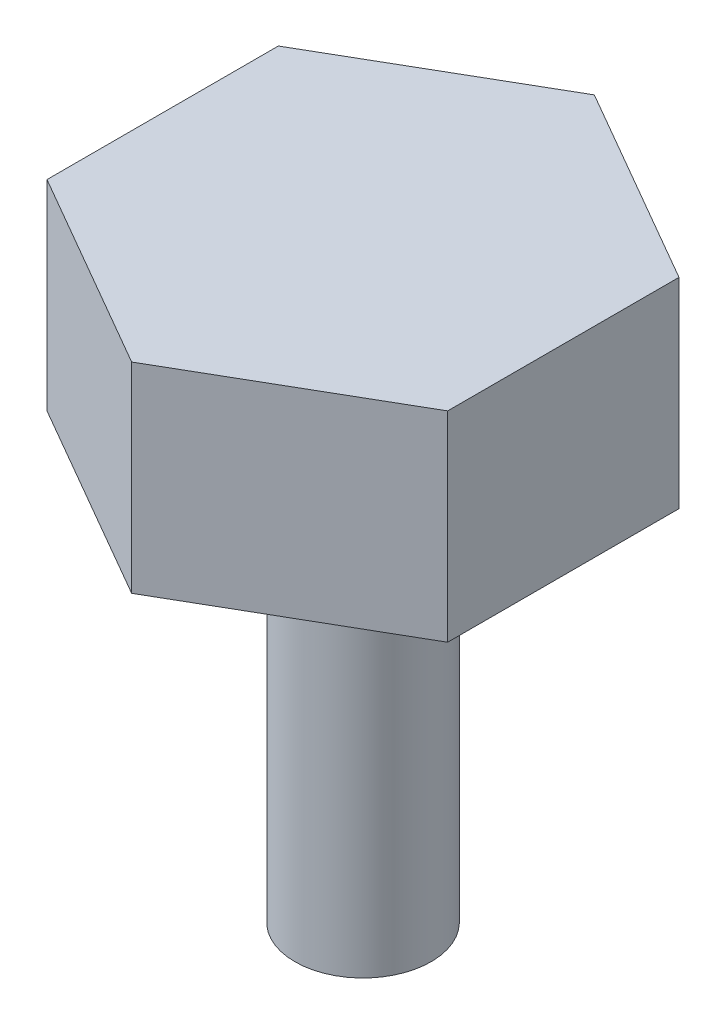
ISO-10303-21;
HEADER;
FILE_DESCRIPTION(('STEP AP214'),'2;1');
FILE_NAME('part.step','',(''),(''),'','','');
FILE_SCHEMA(('AUTOMOTIVE_DESIGN { 1 0 10303 214 1 1 1 1 }'));
ENDSEC;
DATA;
#1=APPLICATION_CONTEXT('core data for automotive mechanical design processes');
#2=APPLICATION_PROTOCOL_DEFINITION('international standard','automotive_design',2000,#1);
#3=PRODUCT_CONTEXT('',#1,'mechanical');
#4=PRODUCT('Part','Part','',(#3));
#5=PRODUCT_RELATED_PRODUCT_CATEGORY('part','',(#4));
#6=PRODUCT_DEFINITION_FORMATION('','',#4);
#7=PRODUCT_DEFINITION_CONTEXT('part definition',#1,'design');
#8=PRODUCT_DEFINITION('design','',#6,#7);
#9=PRODUCT_DEFINITION_SHAPE('','',#8);
#10=(LENGTH_UNIT() NAMED_UNIT(*) SI_UNIT(.MILLI.,.METRE.));
#11=(NAMED_UNIT(*) PLANE_ANGLE_UNIT() SI_UNIT($,.RADIAN.));
#12=(NAMED_UNIT(*) SI_UNIT($,.STERADIAN.) SOLID_ANGLE_UNIT());
#13=UNCERTAINTY_MEASURE_WITH_UNIT(LENGTH_MEASURE(1.E-05),#10,'distance_accuracy_value','');
#14=(GEOMETRIC_REPRESENTATION_CONTEXT(3) GLOBAL_UNCERTAINTY_ASSIGNED_CONTEXT((#13)) GLOBAL_UNIT_ASSIGNED_CONTEXT((#10,
#11,#12)) REPRESENTATION_CONTEXT('',''));
#15=CARTESIAN_POINT('',(0.,0.,0.));
#16=DIRECTION('',(0.,0.,1.));
#17=DIRECTION('',(1.,0.,0.));
#18=AXIS2_PLACEMENT_3D('',#15,#16,#17);
#19=CARTESIAN_POINT('',(0.,12.7,0.));
#20=DIRECTION('',(0.,-1.,0.));
#21=DIRECTION('',(0.,0.,-1.));
#22=AXIS2_PLACEMENT_3D('',#19,#20,#21);
#23=CYLINDRICAL_SURFACE('',#22,2.159);
#24=CARTESIAN_POINT('',(0.,12.7,0.));
#25=DIRECTION('',(0.,1.,0.));
#26=DIRECTION('',(0.,0.,1.));
#27=AXIS2_PLACEMENT_3D('',#24,#25,#26);
#28=CIRCLE('',#27,2.159);
#29=CARTESIAN_POINT('',(0.,12.7,2.159));
#30=VERTEX_POINT('',#29);
#31=EDGE_CURVE('E11',#30,#30,#28,.T.);
#32=ORIENTED_EDGE('',*,*,#31,.F.);
#33=EDGE_LOOP('',(#32));
#34=FACE_BOUND('',#33,.T.);
#35=CARTESIAN_POINT('',(0.,0.,0.));
#36=DIRECTION('',(0.,1.,0.));
#37=DIRECTION('',(0.,0.,1.));
#38=AXIS2_PLACEMENT_3D('',#35,#36,#37);
#39=CIRCLE('',#38,2.159);
#40=CARTESIAN_POINT('',(0.,0.,2.159));
#41=VERTEX_POINT('',#40);
#42=EDGE_CURVE('E36',#41,#41,#39,.T.);
#43=ORIENTED_EDGE('',*,*,#42,.T.);
#44=EDGE_LOOP('',(#43));
#45=FACE_BOUND('',#44,.T.);
#46=ADVANCED_FACE('F33',(#34,#45),#23,.T.);
#47=CARTESIAN_POINT('',(0.,0.,0.));
#48=DIRECTION('',(0.,1.,0.));
#49=DIRECTION('',(0.,0.,1.));
#50=AXIS2_PLACEMENT_3D('',#47,#48,#49);
#51=PLANE('',#50);
#52=ORIENTED_EDGE('',*,*,#42,.F.);
#53=EDGE_LOOP('',(#52));
#54=FACE_BOUND('',#53,.T.);
#55=ADVANCED_FACE('F141',(#54),#51,.F.);
#56=CARTESIAN_POINT('',(-6.35,19.05,3.66617420935412));
#57=DIRECTION('',(0.5,0.,-0.866025403784439));
#58=DIRECTION('',(-0.866025403784439,0.,-0.5));
#59=AXIS2_PLACEMENT_3D('',#56,#57,#58);
#60=PLANE('',#59);
#61=DIRECTION('',(0.866025403784439,0.,0.5));
#62=VECTOR('',#61,1.);
#63=CARTESIAN_POINT('',(-6.35,12.7,3.66617420935412));
#64=LINE('',#63,#62);
#65=CARTESIAN_POINT('',(-6.35,12.7,3.66617420935412));
#66=VERTEX_POINT('',#65);
#67=CARTESIAN_POINT('',(0.,12.7,7.33234841870824));
#68=VERTEX_POINT('',#67);
#69=EDGE_CURVE('E118',#66,#68,#64,.T.);
#70=ORIENTED_EDGE('',*,*,#69,.T.);
#71=DIRECTION('',(0.,-1.,0.));
#72=VECTOR('',#71,1.);
#73=CARTESIAN_POINT('',(0.,19.05,7.33234841870824));
#74=LINE('',#73,#72);
#75=CARTESIAN_POINT('',(0.,19.05,7.33234841870824));
#76=VERTEX_POINT('',#75);
#77=EDGE_CURVE('E135',#76,#68,#74,.T.);
#78=ORIENTED_EDGE('',*,*,#77,.F.);
#79=DIRECTION('',(0.866025403784439,0.,0.5));
#80=VECTOR('',#79,1.);
#81=CARTESIAN_POINT('',(-6.35,19.05,3.66617420935412));
#82=LINE('',#81,#80);
#83=CARTESIAN_POINT('',(-6.35,19.05,3.66617420935412));
#84=VERTEX_POINT('',#83);
#85=EDGE_CURVE('E128',#84,#76,#82,.T.);
#86=ORIENTED_EDGE('',*,*,#85,.F.);
#87=DIRECTION('',(0.,-1.,0.));
#88=VECTOR('',#87,1.);
#89=CARTESIAN_POINT('',(-6.35,19.05,3.66617420935412));
#90=LINE('',#89,#88);
#91=EDGE_CURVE('E114',#84,#66,#90,.T.);
#92=ORIENTED_EDGE('',*,*,#91,.T.);
#93=EDGE_LOOP('',(#70,#78,#86,#92));
#94=FACE_BOUND('',#93,.T.);
#95=ADVANCED_FACE('F143',(#94),#60,.F.);
#96=CARTESIAN_POINT('',(0.,19.05,7.33234841870824));
#97=DIRECTION('',(-0.5,0.,-0.866025403784439));
#98=DIRECTION('',(-0.866025403784439,0.,0.5));
#99=AXIS2_PLACEMENT_3D('',#96,#97,#98);
#100=PLANE('',#99);
#101=DIRECTION('',(0.866025403784439,0.,-0.5));
#102=VECTOR('',#101,1.);
#103=CARTESIAN_POINT('',(0.,12.7,7.33234841870824));
#104=LINE('',#103,#102);
#105=CARTESIAN_POINT('',(6.35,12.7,3.66617420935412));
#106=VERTEX_POINT('',#105);
#107=EDGE_CURVE('E121',#68,#106,#104,.T.);
#108=ORIENTED_EDGE('',*,*,#107,.T.);
#109=DIRECTION('',(0.,-1.,0.));
#110=VECTOR('',#109,1.);
#111=CARTESIAN_POINT('',(6.35,19.05,3.66617420935412));
#112=LINE('',#111,#110);
#113=CARTESIAN_POINT('',(6.35,19.05,3.66617420935412));
#114=VERTEX_POINT('',#113);
#115=EDGE_CURVE('E132',#114,#106,#112,.T.);
#116=ORIENTED_EDGE('',*,*,#115,.F.);
#117=DIRECTION('',(0.866025403784439,0.,-0.5));
#118=VECTOR('',#117,1.);
#119=CARTESIAN_POINT('',(0.,19.05,7.33234841870824));
#120=LINE('',#119,#118);
#121=EDGE_CURVE('E87',#76,#114,#120,.T.);
#122=ORIENTED_EDGE('',*,*,#121,.F.);
#123=ORIENTED_EDGE('',*,*,#77,.T.);
#124=EDGE_LOOP('',(#108,#116,#122,#123));
#125=FACE_BOUND('',#124,.T.);
#126=ADVANCED_FACE('F148',(#125),#100,.F.);
#127=CARTESIAN_POINT('',(6.35,19.05,3.66617420935412));
#128=DIRECTION('',(-1.,0.,0.));
#129=DIRECTION('',(0.,0.,1.));
#130=AXIS2_PLACEMENT_3D('',#127,#128,#129);
#131=PLANE('',#130);
#132=DIRECTION('',(0.,0.,-1.));
#133=VECTOR('',#132,1.);
#134=CARTESIAN_POINT('',(6.35,12.7,3.66617420935412));
#135=LINE('',#134,#133);
#136=CARTESIAN_POINT('',(6.35,12.7,-3.66617420935413));
#137=VERTEX_POINT('',#136);
#138=EDGE_CURVE('E123',#106,#137,#135,.T.);
#139=ORIENTED_EDGE('',*,*,#138,.T.);
#140=DIRECTION('',(0.,-1.,0.));
#141=VECTOR('',#140,1.);
#142=CARTESIAN_POINT('',(6.35,19.05,-3.66617420935413));
#143=LINE('',#142,#141);
#144=CARTESIAN_POINT('',(6.35,19.05,-3.66617420935413));
#145=VERTEX_POINT('',#144);
#146=EDGE_CURVE('E109',#145,#137,#143,.T.);
#147=ORIENTED_EDGE('',*,*,#146,.F.);
#148=DIRECTION('',(0.,0.,-1.));
#149=VECTOR('',#148,1.);
#150=CARTESIAN_POINT('',(6.35,19.05,3.66617420935412));
#151=LINE('',#150,#149);
#152=EDGE_CURVE('E100',#114,#145,#151,.T.);
#153=ORIENTED_EDGE('',*,*,#152,.F.);
#154=ORIENTED_EDGE('',*,*,#115,.T.);
#155=EDGE_LOOP('',(#139,#147,#153,#154));
#156=FACE_BOUND('',#155,.T.);
#157=ADVANCED_FACE('F155',(#156),#131,.F.);
#158=CARTESIAN_POINT('',(6.35,19.05,-3.66617420935413));
#159=DIRECTION('',(-0.5,0.,0.866025403784439));
#160=DIRECTION('',(0.866025403784439,0.,0.5));
#161=AXIS2_PLACEMENT_3D('',#158,#159,#160);
#162=PLANE('',#161);
#163=DIRECTION('',(-0.866025403784439,0.,-0.5));
#164=VECTOR('',#163,1.);
#165=CARTESIAN_POINT('',(6.35,12.7,-3.66617420935413));
#166=LINE('',#165,#164);
#167=CARTESIAN_POINT('',(0.,12.7,-7.33234841870825));
#168=VERTEX_POINT('',#167);
#169=EDGE_CURVE('E108',#137,#168,#166,.T.);
#170=ORIENTED_EDGE('',*,*,#169,.T.);
#171=DIRECTION('',(0.,-1.,0.));
#172=VECTOR('',#171,1.);
#173=CARTESIAN_POINT('',(0.,19.05,-7.33234841870825));
#174=LINE('',#173,#172);
#175=CARTESIAN_POINT('',(0.,19.05,-7.33234841870825));
#176=VERTEX_POINT('',#175);
#177=EDGE_CURVE('E105',#176,#168,#174,.T.);
#178=ORIENTED_EDGE('',*,*,#177,.F.);
#179=DIRECTION('',(-0.866025403784439,0.,-0.5));
#180=VECTOR('',#179,1.);
#181=CARTESIAN_POINT('',(6.35,19.05,-3.66617420935413));
#182=LINE('',#181,#180);
#183=EDGE_CURVE('E94',#145,#176,#182,.T.);
#184=ORIENTED_EDGE('',*,*,#183,.F.);
#185=ORIENTED_EDGE('',*,*,#146,.T.);
#186=EDGE_LOOP('',(#170,#178,#184,#185));
#187=FACE_BOUND('',#186,.T.);
#188=ADVANCED_FACE('F106',(#187),#162,.F.);
#189=CARTESIAN_POINT('',(0.,19.05,-7.33234841870825));
#190=DIRECTION('',(0.5,0.,0.866025403784439));
#191=DIRECTION('',(0.866025403784439,0.,-0.5));
#192=AXIS2_PLACEMENT_3D('',#189,#190,#191);
#193=PLANE('',#192);
#194=DIRECTION('',(-0.866025403784439,0.,0.5));
#195=VECTOR('',#194,1.);
#196=CARTESIAN_POINT('',(0.,12.7,-7.33234841870825));
#197=LINE('',#196,#195);
#198=CARTESIAN_POINT('',(-6.35,12.7,-3.66617420935413));
#199=VERTEX_POINT('',#198);
#200=EDGE_CURVE('E72',#168,#199,#197,.T.);
#201=ORIENTED_EDGE('',*,*,#200,.T.);
#202=DIRECTION('',(0.,-1.,0.));
#203=VECTOR('',#202,1.);
#204=CARTESIAN_POINT('',(-6.35,19.05,-3.66617420935413));
#205=LINE('',#204,#203);
#206=CARTESIAN_POINT('',(-6.35,19.05,-3.66617420935413));
#207=VERTEX_POINT('',#206);
#208=EDGE_CURVE('E110',#207,#199,#205,.T.);
#209=ORIENTED_EDGE('',*,*,#208,.F.);
#210=DIRECTION('',(-0.866025403784439,0.,0.5));
#211=VECTOR('',#210,1.);
#212=CARTESIAN_POINT('',(0.,19.05,-7.33234841870825));
#213=LINE('',#212,#211);
#214=EDGE_CURVE('E98',#176,#207,#213,.T.);
#215=ORIENTED_EDGE('',*,*,#214,.F.);
#216=ORIENTED_EDGE('',*,*,#177,.T.);
#217=EDGE_LOOP('',(#201,#209,#215,#216));
#218=FACE_BOUND('',#217,.T.);
#219=ADVANCED_FACE('F112',(#218),#193,.F.);
#220=CARTESIAN_POINT('',(-6.35,19.05,-3.66617420935413));
#221=DIRECTION('',(1.,0.,0.));
#222=DIRECTION('',(0.,0.,-1.));
#223=AXIS2_PLACEMENT_3D('',#220,#221,#222);
#224=PLANE('',#223);
#225=DIRECTION('',(0.,0.,1.));
#226=VECTOR('',#225,1.);
#227=CARTESIAN_POINT('',(-6.35,12.7,-3.66617420935413));
#228=LINE('',#227,#226);
#229=EDGE_CURVE('E78',#199,#66,#228,.T.);
#230=ORIENTED_EDGE('',*,*,#229,.T.);
#231=ORIENTED_EDGE('',*,*,#91,.F.);
#232=DIRECTION('',(0.,0.,1.));
#233=VECTOR('',#232,1.);
#234=CARTESIAN_POINT('',(-6.35,19.05,-3.66617420935413));
#235=LINE('',#234,#233);
#236=EDGE_CURVE('E49',#207,#84,#235,.T.);
#237=ORIENTED_EDGE('',*,*,#236,.F.);
#238=ORIENTED_EDGE('',*,*,#208,.T.);
#239=EDGE_LOOP('',(#230,#231,#237,#238));
#240=FACE_BOUND('',#239,.T.);
#241=ADVANCED_FACE('F163',(#240),#224,.F.);
#242=CARTESIAN_POINT('',(0.,19.05,0.));
#243=DIRECTION('',(0.,1.,0.));
#244=DIRECTION('',(0.,0.,1.));
#245=AXIS2_PLACEMENT_3D('',#242,#243,#244);
#246=PLANE('',#245);
#247=ORIENTED_EDGE('',*,*,#85,.T.);
#248=ORIENTED_EDGE('',*,*,#121,.T.);
#249=ORIENTED_EDGE('',*,*,#152,.T.);
#250=ORIENTED_EDGE('',*,*,#183,.T.);
#251=ORIENTED_EDGE('',*,*,#214,.T.);
#252=ORIENTED_EDGE('',*,*,#236,.T.);
#253=EDGE_LOOP('',(#247,#248,#249,#250,#251,#252));
#254=FACE_BOUND('',#253,.T.);
#255=ADVANCED_FACE('F96',(#254),#246,.T.);
#256=CARTESIAN_POINT('',(0.,12.7,0.));
#257=DIRECTION('',(0.,1.,0.));
#258=DIRECTION('',(0.,0.,1.));
#259=AXIS2_PLACEMENT_3D('',#256,#257,#258);
#260=PLANE('',#259);
#261=ORIENTED_EDGE('',*,*,#31,.T.);
#262=EDGE_LOOP('',(#261));
#263=FACE_BOUND('',#262,.T.);
#264=ORIENTED_EDGE('',*,*,#69,.F.);
#265=ORIENTED_EDGE('',*,*,#229,.F.);
#266=ORIENTED_EDGE('',*,*,#200,.F.);
#267=ORIENTED_EDGE('',*,*,#169,.F.);
#268=ORIENTED_EDGE('',*,*,#138,.F.);
#269=ORIENTED_EDGE('',*,*,#107,.F.);
#270=EDGE_LOOP('',(#264,#265,#266,#267,#268,#269));
#271=FACE_BOUND('',#270,.T.);
#272=ADVANCED_FACE('F166',(#263,#271),#260,.F.);
#273=CLOSED_SHELL('',(#46,#55,#95,#126,#157,#188,#219,#241,#255,#272));
#274=MANIFOLD_SOLID_BREP('B2',#273);
#275=ADVANCED_BREP_SHAPE_REPRESENTATION('',(#18,#274),#14);
#276=SHAPE_DEFINITION_REPRESENTATION(#9,#275);
ENDSEC;
END-ISO-10303-21;
